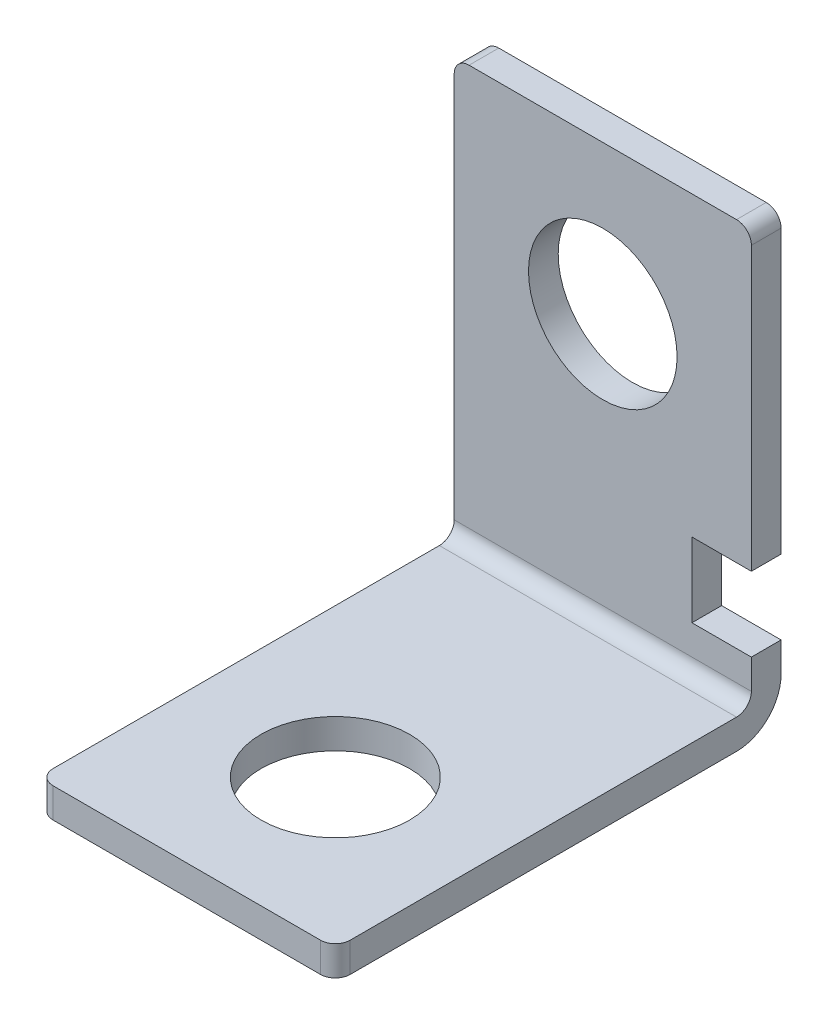
ISO-10303-21;
HEADER;
FILE_DESCRIPTION(('STEP AP214'),'2;1');
FILE_NAME('part.step','',(''),(''),'','','');
FILE_SCHEMA(('AUTOMOTIVE_DESIGN { 1 0 10303 214 1 1 1 1 }'));
ENDSEC;
DATA;
#1=APPLICATION_CONTEXT('core data for automotive mechanical design processes');
#2=APPLICATION_PROTOCOL_DEFINITION('international standard','automotive_design',2000,#1);
#3=PRODUCT_CONTEXT('',#1,'mechanical');
#4=PRODUCT('Part','Part','',(#3));
#5=PRODUCT_RELATED_PRODUCT_CATEGORY('part','',(#4));
#6=PRODUCT_DEFINITION_FORMATION('','',#4);
#7=PRODUCT_DEFINITION_CONTEXT('part definition',#1,'design');
#8=PRODUCT_DEFINITION('design','',#6,#7);
#9=PRODUCT_DEFINITION_SHAPE('','',#8);
#10=(LENGTH_UNIT() NAMED_UNIT(*) SI_UNIT(.MILLI.,.METRE.));
#11=(NAMED_UNIT(*) PLANE_ANGLE_UNIT() SI_UNIT($,.RADIAN.));
#12=(NAMED_UNIT(*) SI_UNIT($,.STERADIAN.) SOLID_ANGLE_UNIT());
#13=UNCERTAINTY_MEASURE_WITH_UNIT(LENGTH_MEASURE(1.E-05),#10,'distance_accuracy_value','');
#14=(GEOMETRIC_REPRESENTATION_CONTEXT(3) GLOBAL_UNCERTAINTY_ASSIGNED_CONTEXT((#13)) GLOBAL_UNIT_ASSIGNED_CONTEXT((#10,
#11,#12)) REPRESENTATION_CONTEXT('',''));
#15=CARTESIAN_POINT('',(0.,0.,0.));
#16=DIRECTION('',(0.,0.,1.));
#17=DIRECTION('',(1.,0.,0.));
#18=AXIS2_PLACEMENT_3D('',#15,#16,#17);
#19=CARTESIAN_POINT('',(10.,0.,0.));
#20=DIRECTION('',(-1.,0.,0.));
#21=DIRECTION('',(0.,0.,1.));
#22=AXIS2_PLACEMENT_3D('',#19,#20,#21);
#23=PLANE('',#22);
#24=DIRECTION('',(0.,0.,-1.));
#25=VECTOR('',#24,1.);
#26=CARTESIAN_POINT('',(10.,2.,30.));
#27=LINE('',#26,#25);
#28=CARTESIAN_POINT('',(10.,2.,29.));
#29=VERTEX_POINT('',#28);
#30=CARTESIAN_POINT('',(10.,2.,3.));
#31=VERTEX_POINT('',#30);
#32=EDGE_CURVE('E192',#29,#31,#27,.T.);
#33=ORIENTED_EDGE('',*,*,#32,.F.);
#34=DIRECTION('',(0.,1.,0.));
#35=VECTOR('',#34,1.);
#36=CARTESIAN_POINT('',(10.,0.,29.));
#37=LINE('',#36,#35);
#38=CARTESIAN_POINT('',(10.,0.,29.));
#39=VERTEX_POINT('',#38);
#40=EDGE_CURVE('E264',#29,#39,#37,.F.);
#41=ORIENTED_EDGE('',*,*,#40,.T.);
#42=DIRECTION('',(0.,0.,-1.));
#43=VECTOR('',#42,1.);
#44=CARTESIAN_POINT('',(10.,0.,30.));
#45=LINE('',#44,#43);
#46=CARTESIAN_POINT('',(10.,0.,3.00000000000001));
#47=VERTEX_POINT('',#46);
#48=EDGE_CURVE('E194',#39,#47,#45,.T.);
#49=ORIENTED_EDGE('',*,*,#48,.T.);
#50=CARTESIAN_POINT('',(10.,3.,3.));
#51=DIRECTION('',(-1.,0.,0.));
#52=DIRECTION('',(0.,0.,1.));
#53=AXIS2_PLACEMENT_3D('',#50,#51,#52);
#54=CIRCLE('',#53,3.);
#55=CARTESIAN_POINT('',(10.,3.,0.));
#56=VERTEX_POINT('',#55);
#57=EDGE_CURVE('E228',#47,#56,#54,.F.);
#58=ORIENTED_EDGE('',*,*,#57,.T.);
#59=DIRECTION('',(0.,1.,0.));
#60=VECTOR('',#59,1.);
#61=CARTESIAN_POINT('',(10.,0.,0.));
#62=LINE('',#61,#60);
#63=CARTESIAN_POINT('',(10.,5.,0.));
#64=VERTEX_POINT('',#63);
#65=EDGE_CURVE('E186',#56,#64,#62,.T.);
#66=ORIENTED_EDGE('',*,*,#65,.T.);
#67=DIRECTION('',(0.,0.,-1.));
#68=VECTOR('',#67,1.);
#69=CARTESIAN_POINT('',(10.,5.,0.));
#70=LINE('',#69,#68);
#71=CARTESIAN_POINT('',(10.,5.,2.));
#72=VERTEX_POINT('',#71);
#73=EDGE_CURVE('E215',#72,#64,#70,.T.);
#74=ORIENTED_EDGE('',*,*,#73,.F.);
#75=DIRECTION('',(0.,1.,0.));
#76=VECTOR('',#75,1.);
#77=CARTESIAN_POINT('',(10.,0.,2.));
#78=LINE('',#77,#76);
#79=CARTESIAN_POINT('',(10.,3.,2.));
#80=VERTEX_POINT('',#79);
#81=EDGE_CURVE('E190',#80,#72,#78,.T.);
#82=ORIENTED_EDGE('',*,*,#81,.F.);
#83=CARTESIAN_POINT('',(10.,3.,3.));
#84=DIRECTION('',(-1.,0.,0.));
#85=DIRECTION('',(0.,0.,1.));
#86=AXIS2_PLACEMENT_3D('',#83,#84,#85);
#87=CIRCLE('',#86,1.);
#88=EDGE_CURVE('E237',#80,#31,#87,.T.);
#89=ORIENTED_EDGE('',*,*,#88,.T.);
#90=EDGE_LOOP('',(#33,#41,#49,#58,#66,#74,#82,#89));
#91=FACE_BOUND('',#90,.T.);
#92=ADVANCED_FACE('F36',(#91),#23,.F.);
#93=CARTESIAN_POINT('',(10.,0.,0.));
#94=DIRECTION('',(0.,0.,1.));
#95=DIRECTION('',(1.,0.,0.));
#96=AXIS2_PLACEMENT_3D('',#93,#94,#95);
#97=PLANE('',#96);
#98=CARTESIAN_POINT('',(0.,20.,0.));
#99=DIRECTION('',(0.,0.,1.));
#100=DIRECTION('',(1.,0.,0.));
#101=AXIS2_PLACEMENT_3D('',#98,#99,#100);
#102=CIRCLE('',#101,5.);
#103=CARTESIAN_POINT('',(5.,20.,0.));
#104=VERTEX_POINT('',#103);
#105=EDGE_CURVE('E171',#104,#104,#102,.T.);
#106=ORIENTED_EDGE('',*,*,#105,.T.);
#107=EDGE_LOOP('',(#106));
#108=FACE_BOUND('',#107,.T.);
#109=DIRECTION('',(0.,1.,0.));
#110=VECTOR('',#109,1.);
#111=CARTESIAN_POINT('',(-10.,0.,0.));
#112=LINE('',#111,#110);
#113=CARTESIAN_POINT('',(-10.,3.,0.));
#114=VERTEX_POINT('',#113);
#115=CARTESIAN_POINT('',(-10.,29.,0.));
#116=VERTEX_POINT('',#115);
#117=EDGE_CURVE('E185',#114,#116,#112,.T.);
#118=ORIENTED_EDGE('',*,*,#117,.T.);
#119=CARTESIAN_POINT('',(-9.,29.,0.));
#120=DIRECTION('',(0.,0.,1.));
#121=DIRECTION('',(1.,0.,0.));
#122=AXIS2_PLACEMENT_3D('',#119,#120,#121);
#123=CIRCLE('',#122,1.);
#124=CARTESIAN_POINT('',(-9.,30.,0.));
#125=VERTEX_POINT('',#124);
#126=EDGE_CURVE('E268',#116,#125,#123,.F.);
#127=ORIENTED_EDGE('',*,*,#126,.T.);
#128=DIRECTION('',(-1.,0.,0.));
#129=VECTOR('',#128,1.);
#130=CARTESIAN_POINT('',(10.,30.,0.));
#131=LINE('',#130,#129);
#132=CARTESIAN_POINT('',(9.,30.,0.));
#133=VERTEX_POINT('',#132);
#134=EDGE_CURVE('E213',#133,#125,#131,.T.);
#135=ORIENTED_EDGE('',*,*,#134,.F.);
#136=CARTESIAN_POINT('',(9.,29.,0.));
#137=DIRECTION('',(0.,0.,1.));
#138=DIRECTION('',(1.,0.,0.));
#139=AXIS2_PLACEMENT_3D('',#136,#137,#138);
#140=CIRCLE('',#139,1.);
#141=CARTESIAN_POINT('',(10.,29.,0.));
#142=VERTEX_POINT('',#141);
#143=EDGE_CURVE('E266',#133,#142,#140,.F.);
#144=ORIENTED_EDGE('',*,*,#143,.T.);
#145=CARTESIAN_POINT('',(10.,10.,0.));
#146=VERTEX_POINT('',#145);
#147=EDGE_CURVE('E189',#146,#142,#62,.T.);
#148=ORIENTED_EDGE('',*,*,#147,.F.);
#149=DIRECTION('',(-1.,0.,0.));
#150=VECTOR('',#149,1.);
#151=CARTESIAN_POINT('',(10.,10.,0.));
#152=LINE('',#151,#150);
#153=CARTESIAN_POINT('',(6.,10.,0.));
#154=VERTEX_POINT('',#153);
#155=EDGE_CURVE('E182',#146,#154,#152,.T.);
#156=ORIENTED_EDGE('',*,*,#155,.T.);
#157=DIRECTION('',(0.,-1.,0.));
#158=VECTOR('',#157,1.);
#159=CARTESIAN_POINT('',(6.,0.,0.));
#160=LINE('',#159,#158);
#161=CARTESIAN_POINT('',(6.,5.,0.));
#162=VERTEX_POINT('',#161);
#163=EDGE_CURVE('E159',#154,#162,#160,.T.);
#164=ORIENTED_EDGE('',*,*,#163,.T.);
#165=DIRECTION('',(-1.,0.,0.));
#166=VECTOR('',#165,1.);
#167=CARTESIAN_POINT('',(10.,5.,0.));
#168=LINE('',#167,#166);
#169=EDGE_CURVE('E179',#64,#162,#168,.T.);
#170=ORIENTED_EDGE('',*,*,#169,.F.);
#171=ORIENTED_EDGE('',*,*,#65,.F.);
#172=DIRECTION('',(-1.,0.,0.));
#173=VECTOR('',#172,1.);
#174=CARTESIAN_POINT('',(10.,3.,0.));
#175=LINE('',#174,#173);
#176=EDGE_CURVE('E219',#56,#114,#175,.T.);
#177=ORIENTED_EDGE('',*,*,#176,.T.);
#178=EDGE_LOOP('',(#118,#127,#135,#144,#148,#156,#164,#170,#171,#177));
#179=FACE_BOUND('',#178,.T.);
#180=ADVANCED_FACE('F288',(#108,#179),#97,.F.);
#181=CARTESIAN_POINT('',(10.,30.,2.));
#182=DIRECTION('',(0.,1.,0.));
#183=DIRECTION('',(0.,0.,1.));
#184=AXIS2_PLACEMENT_3D('',#181,#182,#183);
#185=PLANE('',#184);
#186=ORIENTED_EDGE('',*,*,#134,.T.);
#187=DIRECTION('',(0.,0.,-1.));
#188=VECTOR('',#187,1.);
#189=CARTESIAN_POINT('',(-9.,30.,2.));
#190=LINE('',#189,#188);
#191=CARTESIAN_POINT('',(-9.,30.,2.));
#192=VERTEX_POINT('',#191);
#193=EDGE_CURVE('E57',#125,#192,#190,.F.);
#194=ORIENTED_EDGE('',*,*,#193,.T.);
#195=DIRECTION('',(-1.,0.,0.));
#196=VECTOR('',#195,1.);
#197=CARTESIAN_POINT('',(10.,30.,2.));
#198=LINE('',#197,#196);
#199=CARTESIAN_POINT('',(9.,30.,2.));
#200=VERTEX_POINT('',#199);
#201=EDGE_CURVE('E211',#200,#192,#198,.T.);
#202=ORIENTED_EDGE('',*,*,#201,.F.);
#203=DIRECTION('',(0.,0.,-1.));
#204=VECTOR('',#203,1.);
#205=CARTESIAN_POINT('',(9.,30.,0.));
#206=LINE('',#205,#204);
#207=EDGE_CURVE('E270',#200,#133,#206,.T.);
#208=ORIENTED_EDGE('',*,*,#207,.T.);
#209=EDGE_LOOP('',(#186,#194,#202,#208));
#210=FACE_BOUND('',#209,.T.);
#211=ADVANCED_FACE('F289',(#210),#185,.T.);
#212=CARTESIAN_POINT('',(10.,0.,2.));
#213=DIRECTION('',(0.,0.,1.));
#214=DIRECTION('',(1.,0.,0.));
#215=AXIS2_PLACEMENT_3D('',#212,#213,#214);
#216=PLANE('',#215);
#217=CARTESIAN_POINT('',(0.,20.,2.));
#218=DIRECTION('',(0.,0.,1.));
#219=DIRECTION('',(1.,0.,0.));
#220=AXIS2_PLACEMENT_3D('',#217,#218,#219);
#221=CIRCLE('',#220,5.);
#222=CARTESIAN_POINT('',(5.,20.,2.));
#223=VERTEX_POINT('',#222);
#224=EDGE_CURVE('E244',#223,#223,#221,.T.);
#225=ORIENTED_EDGE('',*,*,#224,.F.);
#226=EDGE_LOOP('',(#225));
#227=FACE_BOUND('',#226,.T.);
#228=ORIENTED_EDGE('',*,*,#201,.T.);
#229=CARTESIAN_POINT('',(-9.,29.,2.));
#230=DIRECTION('',(0.,0.,1.));
#231=DIRECTION('',(1.,0.,0.));
#232=AXIS2_PLACEMENT_3D('',#229,#230,#231);
#233=CIRCLE('',#232,1.);
#234=CARTESIAN_POINT('',(-10.,29.,2.));
#235=VERTEX_POINT('',#234);
#236=EDGE_CURVE('E44',#192,#235,#233,.T.);
#237=ORIENTED_EDGE('',*,*,#236,.T.);
#238=DIRECTION('',(0.,1.,0.));
#239=VECTOR('',#238,1.);
#240=CARTESIAN_POINT('',(-10.,0.,2.));
#241=LINE('',#240,#239);
#242=CARTESIAN_POINT('',(-10.,3.,2.));
#243=VERTEX_POINT('',#242);
#244=EDGE_CURVE('E199',#243,#235,#241,.T.);
#245=ORIENTED_EDGE('',*,*,#244,.F.);
#246=DIRECTION('',(-1.,0.,0.));
#247=VECTOR('',#246,1.);
#248=CARTESIAN_POINT('',(10.,3.,2.));
#249=LINE('',#248,#247);
#250=EDGE_CURVE('E233',#243,#80,#249,.F.);
#251=ORIENTED_EDGE('',*,*,#250,.T.);
#252=ORIENTED_EDGE('',*,*,#81,.T.);
#253=DIRECTION('',(-1.,0.,0.));
#254=VECTOR('',#253,1.);
#255=CARTESIAN_POINT('',(10.,5.,2.));
#256=LINE('',#255,#254);
#257=CARTESIAN_POINT('',(6.,5.,2.));
#258=VERTEX_POINT('',#257);
#259=EDGE_CURVE('E163',#72,#258,#256,.T.);
#260=ORIENTED_EDGE('',*,*,#259,.T.);
#261=DIRECTION('',(0.,-1.,0.));
#262=VECTOR('',#261,1.);
#263=CARTESIAN_POINT('',(6.,10.,2.));
#264=LINE('',#263,#262);
#265=CARTESIAN_POINT('',(6.,10.,2.));
#266=VERTEX_POINT('',#265);
#267=EDGE_CURVE('E156',#266,#258,#264,.T.);
#268=ORIENTED_EDGE('',*,*,#267,.F.);
#269=DIRECTION('',(-1.,0.,0.));
#270=VECTOR('',#269,1.);
#271=CARTESIAN_POINT('',(10.,10.,2.));
#272=LINE('',#271,#270);
#273=CARTESIAN_POINT('',(10.,10.,2.));
#274=VERTEX_POINT('',#273);
#275=EDGE_CURVE('E166',#274,#266,#272,.T.);
#276=ORIENTED_EDGE('',*,*,#275,.F.);
#277=CARTESIAN_POINT('',(10.,29.,2.));
#278=VERTEX_POINT('',#277);
#279=EDGE_CURVE('E188',#274,#278,#78,.T.);
#280=ORIENTED_EDGE('',*,*,#279,.T.);
#281=CARTESIAN_POINT('',(9.,29.,2.));
#282=DIRECTION('',(0.,0.,1.));
#283=DIRECTION('',(1.,0.,0.));
#284=AXIS2_PLACEMENT_3D('',#281,#282,#283);
#285=CIRCLE('',#284,1.);
#286=EDGE_CURVE('E274',#278,#200,#285,.T.);
#287=ORIENTED_EDGE('',*,*,#286,.T.);
#288=EDGE_LOOP('',(#228,#237,#245,#251,#252,#260,#268,#276,#280,#287));
#289=FACE_BOUND('',#288,.T.);
#290=ADVANCED_FACE('F173',(#227,#289),#216,.T.);
#291=CARTESIAN_POINT('',(10.,2.,30.));
#292=DIRECTION('',(0.,1.,0.));
#293=DIRECTION('',(0.,0.,1.));
#294=AXIS2_PLACEMENT_3D('',#291,#292,#293);
#295=PLANE('',#294);
#296=CARTESIAN_POINT('',(0.,2.,20.));
#297=DIRECTION('',(0.,1.,0.));
#298=DIRECTION('',(0.,0.,1.));
#299=AXIS2_PLACEMENT_3D('',#296,#297,#298);
#300=CIRCLE('',#299,5.);
#301=CARTESIAN_POINT('',(0.,2.,25.));
#302=VERTEX_POINT('',#301);
#303=EDGE_CURVE('E245',#302,#302,#300,.T.);
#304=ORIENTED_EDGE('',*,*,#303,.F.);
#305=EDGE_LOOP('',(#304));
#306=FACE_BOUND('',#305,.T.);
#307=DIRECTION('',(0.,0.,-1.));
#308=VECTOR('',#307,1.);
#309=CARTESIAN_POINT('',(-10.,2.,30.));
#310=LINE('',#309,#308);
#311=CARTESIAN_POINT('',(-10.,2.,29.));
#312=VERTEX_POINT('',#311);
#313=CARTESIAN_POINT('',(-10.,2.,3.));
#314=VERTEX_POINT('',#313);
#315=EDGE_CURVE('E202',#312,#314,#310,.T.);
#316=ORIENTED_EDGE('',*,*,#315,.F.);
#317=CARTESIAN_POINT('',(-9.,2.,29.));
#318=DIRECTION('',(0.,1.,0.));
#319=DIRECTION('',(0.,0.,1.));
#320=AXIS2_PLACEMENT_3D('',#317,#318,#319);
#321=CIRCLE('',#320,1.);
#322=CARTESIAN_POINT('',(-9.,2.,30.));
#323=VERTEX_POINT('',#322);
#324=EDGE_CURVE('E253',#312,#323,#321,.T.);
#325=ORIENTED_EDGE('',*,*,#324,.T.);
#326=DIRECTION('',(-1.,0.,0.));
#327=VECTOR('',#326,1.);
#328=CARTESIAN_POINT('',(10.,2.,30.));
#329=LINE('',#328,#327);
#330=CARTESIAN_POINT('',(9.,2.,30.));
#331=VERTEX_POINT('',#330);
#332=EDGE_CURVE('E208',#331,#323,#329,.T.);
#333=ORIENTED_EDGE('',*,*,#332,.F.);
#334=CARTESIAN_POINT('',(9.,2.,29.));
#335=DIRECTION('',(0.,1.,0.));
#336=DIRECTION('',(0.,0.,1.));
#337=AXIS2_PLACEMENT_3D('',#334,#335,#336);
#338=CIRCLE('',#337,1.);
#339=EDGE_CURVE('E251',#331,#29,#338,.T.);
#340=ORIENTED_EDGE('',*,*,#339,.T.);
#341=ORIENTED_EDGE('',*,*,#32,.T.);
#342=DIRECTION('',(-1.,0.,0.));
#343=VECTOR('',#342,1.);
#344=CARTESIAN_POINT('',(-10.,2.,3.));
#345=LINE('',#344,#343);
#346=EDGE_CURVE('E230',#31,#314,#345,.T.);
#347=ORIENTED_EDGE('',*,*,#346,.T.);
#348=EDGE_LOOP('',(#316,#325,#333,#340,#341,#347));
#349=FACE_BOUND('',#348,.T.);
#350=ADVANCED_FACE('F347',(#306,#349),#295,.T.);
#351=CARTESIAN_POINT('',(10.,0.,30.));
#352=DIRECTION('',(0.,0.,1.));
#353=DIRECTION('',(1.,0.,0.));
#354=AXIS2_PLACEMENT_3D('',#351,#352,#353);
#355=PLANE('',#354);
#356=ORIENTED_EDGE('',*,*,#332,.T.);
#357=DIRECTION('',(0.,1.,0.));
#358=VECTOR('',#357,1.);
#359=CARTESIAN_POINT('',(-9.,0.,30.));
#360=LINE('',#359,#358);
#361=CARTESIAN_POINT('',(-9.,0.,30.));
#362=VERTEX_POINT('',#361);
#363=EDGE_CURVE('E258',#323,#362,#360,.F.);
#364=ORIENTED_EDGE('',*,*,#363,.T.);
#365=DIRECTION('',(-1.,0.,0.));
#366=VECTOR('',#365,1.);
#367=CARTESIAN_POINT('',(10.,0.,30.));
#368=LINE('',#367,#366);
#369=CARTESIAN_POINT('',(9.,0.,30.));
#370=VERTEX_POINT('',#369);
#371=EDGE_CURVE('E196',#370,#362,#368,.T.);
#372=ORIENTED_EDGE('',*,*,#371,.F.);
#373=DIRECTION('',(0.,1.,0.));
#374=VECTOR('',#373,1.);
#375=CARTESIAN_POINT('',(9.,2.,30.));
#376=LINE('',#375,#374);
#377=EDGE_CURVE('E255',#370,#331,#376,.T.);
#378=ORIENTED_EDGE('',*,*,#377,.T.);
#379=EDGE_LOOP('',(#356,#364,#372,#378));
#380=FACE_BOUND('',#379,.T.);
#381=ADVANCED_FACE('F303',(#380),#355,.T.);
#382=CARTESIAN_POINT('',(10.,0.,30.));
#383=DIRECTION('',(0.,1.,0.));
#384=DIRECTION('',(0.,0.,1.));
#385=AXIS2_PLACEMENT_3D('',#382,#383,#384);
#386=PLANE('',#385);
#387=CARTESIAN_POINT('',(0.,0.,20.));
#388=DIRECTION('',(0.,1.,0.));
#389=DIRECTION('',(0.,0.,1.));
#390=AXIS2_PLACEMENT_3D('',#387,#388,#389);
#391=CIRCLE('',#390,5.);
#392=CARTESIAN_POINT('',(0.,0.,25.));
#393=VERTEX_POINT('',#392);
#394=EDGE_CURVE('E241',#393,#393,#391,.T.);
#395=ORIENTED_EDGE('',*,*,#394,.T.);
#396=EDGE_LOOP('',(#395));
#397=FACE_BOUND('',#396,.T.);
#398=ORIENTED_EDGE('',*,*,#371,.T.);
#399=CARTESIAN_POINT('',(-9.,0.,29.));
#400=DIRECTION('',(0.,1.,0.));
#401=DIRECTION('',(0.,0.,1.));
#402=AXIS2_PLACEMENT_3D('',#399,#400,#401);
#403=CIRCLE('',#402,1.);
#404=CARTESIAN_POINT('',(-10.,0.,29.));
#405=VERTEX_POINT('',#404);
#406=EDGE_CURVE('E262',#362,#405,#403,.F.);
#407=ORIENTED_EDGE('',*,*,#406,.T.);
#408=DIRECTION('',(0.,0.,-1.));
#409=VECTOR('',#408,1.);
#410=CARTESIAN_POINT('',(-10.,0.,30.));
#411=LINE('',#410,#409);
#412=CARTESIAN_POINT('',(-10.,0.,3.00000000000001));
#413=VERTEX_POINT('',#412);
#414=EDGE_CURVE('E204',#405,#413,#411,.T.);
#415=ORIENTED_EDGE('',*,*,#414,.T.);
#416=DIRECTION('',(-1.,0.,0.));
#417=VECTOR('',#416,1.);
#418=CARTESIAN_POINT('',(10.,0.,3.));
#419=LINE('',#418,#417);
#420=EDGE_CURVE('E225',#413,#47,#419,.F.);
#421=ORIENTED_EDGE('',*,*,#420,.T.);
#422=ORIENTED_EDGE('',*,*,#48,.F.);
#423=CARTESIAN_POINT('',(9.,0.,29.));
#424=DIRECTION('',(0.,1.,0.));
#425=DIRECTION('',(0.,0.,1.));
#426=AXIS2_PLACEMENT_3D('',#423,#424,#425);
#427=CIRCLE('',#426,1.);
#428=EDGE_CURVE('E260',#39,#370,#427,.F.);
#429=ORIENTED_EDGE('',*,*,#428,.T.);
#430=EDGE_LOOP('',(#398,#407,#415,#421,#422,#429));
#431=FACE_BOUND('',#430,.T.);
#432=ADVANCED_FACE('F296',(#397,#431),#386,.F.);
#433=ORIENTED_EDGE('',*,*,#147,.T.);
#434=DIRECTION('',(0.,0.,-1.));
#435=VECTOR('',#434,1.);
#436=CARTESIAN_POINT('',(10.,29.,2.));
#437=LINE('',#436,#435);
#438=EDGE_CURVE('E11',#142,#278,#437,.F.);
#439=ORIENTED_EDGE('',*,*,#438,.T.);
#440=ORIENTED_EDGE('',*,*,#279,.F.);
#441=DIRECTION('',(0.,0.,-1.));
#442=VECTOR('',#441,1.);
#443=CARTESIAN_POINT('',(10.,10.,0.));
#444=LINE('',#443,#442);
#445=EDGE_CURVE('E169',#274,#146,#444,.T.);
#446=ORIENTED_EDGE('',*,*,#445,.T.);
#447=EDGE_LOOP('',(#433,#439,#440,#446));
#448=FACE_BOUND('',#447,.T.);
#449=ADVANCED_FACE('F294',(#448),#23,.F.);
#450=CARTESIAN_POINT('',(-10.,0.,0.));
#451=DIRECTION('',(-1.,0.,0.));
#452=DIRECTION('',(0.,0.,1.));
#453=AXIS2_PLACEMENT_3D('',#450,#451,#452);
#454=PLANE('',#453);
#455=ORIENTED_EDGE('',*,*,#414,.F.);
#456=DIRECTION('',(0.,1.,0.));
#457=VECTOR('',#456,1.);
#458=CARTESIAN_POINT('',(-10.,0.,29.));
#459=LINE('',#458,#457);
#460=EDGE_CURVE('E248',#405,#312,#459,.T.);
#461=ORIENTED_EDGE('',*,*,#460,.T.);
#462=ORIENTED_EDGE('',*,*,#315,.T.);
#463=CARTESIAN_POINT('',(-10.,3.,3.));
#464=DIRECTION('',(-1.,0.,0.));
#465=DIRECTION('',(0.,0.,1.));
#466=AXIS2_PLACEMENT_3D('',#463,#464,#465);
#467=CIRCLE('',#466,1.);
#468=EDGE_CURVE('E235',#314,#243,#467,.F.);
#469=ORIENTED_EDGE('',*,*,#468,.T.);
#470=ORIENTED_EDGE('',*,*,#244,.T.);
#471=DIRECTION('',(0.,0.,-1.));
#472=VECTOR('',#471,1.);
#473=CARTESIAN_POINT('',(-10.,29.,0.));
#474=LINE('',#473,#472);
#475=EDGE_CURVE('E240',#235,#116,#474,.T.);
#476=ORIENTED_EDGE('',*,*,#475,.T.);
#477=ORIENTED_EDGE('',*,*,#117,.F.);
#478=CARTESIAN_POINT('',(-10.,3.,3.));
#479=DIRECTION('',(-1.,0.,0.));
#480=DIRECTION('',(0.,0.,1.));
#481=AXIS2_PLACEMENT_3D('',#478,#479,#480);
#482=CIRCLE('',#481,3.);
#483=EDGE_CURVE('E222',#114,#413,#482,.T.);
#484=ORIENTED_EDGE('',*,*,#483,.T.);
#485=EDGE_LOOP('',(#455,#461,#462,#469,#470,#476,#477,#484));
#486=FACE_BOUND('',#485,.T.);
#487=ADVANCED_FACE('F282',(#486),#454,.T.);
#488=CARTESIAN_POINT('',(6.,10.,-8.));
#489=DIRECTION('',(-1.,0.,0.));
#490=DIRECTION('',(0.,-1.,0.));
#491=AXIS2_PLACEMENT_3D('',#488,#489,#490);
#492=PLANE('',#491);
#493=DIRECTION('',(0.,0.,1.));
#494=VECTOR('',#493,1.);
#495=CARTESIAN_POINT('',(6.,10.,-8.));
#496=LINE('',#495,#494);
#497=EDGE_CURVE('E151',#154,#266,#496,.T.);
#498=ORIENTED_EDGE('',*,*,#497,.T.);
#499=ORIENTED_EDGE('',*,*,#267,.T.);
#500=DIRECTION('',(0.,0.,1.));
#501=VECTOR('',#500,1.);
#502=CARTESIAN_POINT('',(6.,5.,-8.));
#503=LINE('',#502,#501);
#504=EDGE_CURVE('E162',#162,#258,#503,.T.);
#505=ORIENTED_EDGE('',*,*,#504,.F.);
#506=ORIENTED_EDGE('',*,*,#163,.F.);
#507=EDGE_LOOP('',(#498,#499,#505,#506));
#508=FACE_BOUND('',#507,.T.);
#509=ADVANCED_FACE('F153',(#508),#492,.F.);
#510=CARTESIAN_POINT('',(10.,10.,-8.));
#511=DIRECTION('',(0.,1.,0.));
#512=DIRECTION('',(-1.,0.,0.));
#513=AXIS2_PLACEMENT_3D('',#510,#511,#512);
#514=PLANE('',#513);
#515=ORIENTED_EDGE('',*,*,#445,.F.);
#516=ORIENTED_EDGE('',*,*,#275,.T.);
#517=ORIENTED_EDGE('',*,*,#497,.F.);
#518=ORIENTED_EDGE('',*,*,#155,.F.);
#519=EDGE_LOOP('',(#515,#516,#517,#518));
#520=FACE_BOUND('',#519,.T.);
#521=ADVANCED_FACE('F167',(#520),#514,.F.);
#522=CARTESIAN_POINT('',(10.,5.,-8.));
#523=DIRECTION('',(0.,1.,0.));
#524=DIRECTION('',(0.,0.,1.));
#525=AXIS2_PLACEMENT_3D('',#522,#523,#524);
#526=PLANE('',#525);
#527=ORIENTED_EDGE('',*,*,#169,.T.);
#528=ORIENTED_EDGE('',*,*,#504,.T.);
#529=ORIENTED_EDGE('',*,*,#259,.F.);
#530=ORIENTED_EDGE('',*,*,#73,.T.);
#531=EDGE_LOOP('',(#527,#528,#529,#530));
#532=FACE_BOUND('',#531,.T.);
#533=ADVANCED_FACE('F344',(#532),#526,.T.);
#534=CARTESIAN_POINT('',(10.,3.,3.));
#535=DIRECTION('',(-1.,0.,0.));
#536=DIRECTION('',(0.,0.,1.));
#537=AXIS2_PLACEMENT_3D('',#534,#535,#536);
#538=CYLINDRICAL_SURFACE('',#537,3.);
#539=ORIENTED_EDGE('',*,*,#57,.F.);
#540=ORIENTED_EDGE('',*,*,#420,.F.);
#541=ORIENTED_EDGE('',*,*,#483,.F.);
#542=ORIENTED_EDGE('',*,*,#176,.F.);
#543=EDGE_LOOP('',(#539,#540,#541,#542));
#544=FACE_BOUND('',#543,.T.);
#545=ADVANCED_FACE('F339',(#544),#538,.T.);
#546=CARTESIAN_POINT('',(10.,3.,3.));
#547=DIRECTION('',(1.,0.,0.));
#548=DIRECTION('',(0.,0.,-1.));
#549=AXIS2_PLACEMENT_3D('',#546,#547,#548);
#550=CYLINDRICAL_SURFACE('',#549,1.);
#551=ORIENTED_EDGE('',*,*,#88,.F.);
#552=ORIENTED_EDGE('',*,*,#250,.F.);
#553=ORIENTED_EDGE('',*,*,#468,.F.);
#554=ORIENTED_EDGE('',*,*,#346,.F.);
#555=EDGE_LOOP('',(#551,#552,#553,#554));
#556=FACE_BOUND('',#555,.T.);
#557=ADVANCED_FACE('F346',(#556),#550,.F.);
#558=CARTESIAN_POINT('',(0.,20.,-8.));
#559=DIRECTION('',(0.,0.,1.));
#560=DIRECTION('',(1.,0.,0.));
#561=AXIS2_PLACEMENT_3D('',#558,#559,#560);
#562=CYLINDRICAL_SURFACE('',#561,5.);
#563=ORIENTED_EDGE('',*,*,#224,.T.);
#564=EDGE_LOOP('',(#563));
#565=FACE_BOUND('',#564,.T.);
#566=ORIENTED_EDGE('',*,*,#105,.F.);
#567=EDGE_LOOP('',(#566));
#568=FACE_BOUND('',#567,.T.);
#569=ADVANCED_FACE('F366',(#565,#568),#562,.F.);
#570=CARTESIAN_POINT('',(0.,-8.,20.));
#571=DIRECTION('',(0.,1.,0.));
#572=DIRECTION('',(0.,0.,1.));
#573=AXIS2_PLACEMENT_3D('',#570,#571,#572);
#574=CYLINDRICAL_SURFACE('',#573,5.);
#575=ORIENTED_EDGE('',*,*,#303,.T.);
#576=EDGE_LOOP('',(#575));
#577=FACE_BOUND('',#576,.T.);
#578=ORIENTED_EDGE('',*,*,#394,.F.);
#579=EDGE_LOOP('',(#578));
#580=FACE_BOUND('',#579,.T.);
#581=ADVANCED_FACE('F369',(#577,#580),#574,.F.);
#582=CARTESIAN_POINT('',(-9.,0.,29.));
#583=DIRECTION('',(0.,1.,0.));
#584=DIRECTION('',(0.,0.,1.));
#585=AXIS2_PLACEMENT_3D('',#582,#583,#584);
#586=CYLINDRICAL_SURFACE('',#585,1.);
#587=ORIENTED_EDGE('',*,*,#406,.F.);
#588=ORIENTED_EDGE('',*,*,#363,.F.);
#589=ORIENTED_EDGE('',*,*,#324,.F.);
#590=ORIENTED_EDGE('',*,*,#460,.F.);
#591=EDGE_LOOP('',(#587,#588,#589,#590));
#592=FACE_BOUND('',#591,.T.);
#593=ADVANCED_FACE('F332',(#592),#586,.T.);
#594=CARTESIAN_POINT('',(9.,0.,29.));
#595=DIRECTION('',(0.,-1.,0.));
#596=DIRECTION('',(0.,0.,-1.));
#597=AXIS2_PLACEMENT_3D('',#594,#595,#596);
#598=CYLINDRICAL_SURFACE('',#597,1.);
#599=ORIENTED_EDGE('',*,*,#428,.F.);
#600=ORIENTED_EDGE('',*,*,#40,.F.);
#601=ORIENTED_EDGE('',*,*,#339,.F.);
#602=ORIENTED_EDGE('',*,*,#377,.F.);
#603=EDGE_LOOP('',(#599,#600,#601,#602));
#604=FACE_BOUND('',#603,.T.);
#605=ADVANCED_FACE('F323',(#604),#598,.T.);
#606=CARTESIAN_POINT('',(-9.,29.,0.));
#607=DIRECTION('',(0.,0.,-1.));
#608=DIRECTION('',(-1.,0.,0.));
#609=AXIS2_PLACEMENT_3D('',#606,#607,#608);
#610=CYLINDRICAL_SURFACE('',#609,1.);
#611=ORIENTED_EDGE('',*,*,#236,.F.);
#612=ORIENTED_EDGE('',*,*,#193,.F.);
#613=ORIENTED_EDGE('',*,*,#126,.F.);
#614=ORIENTED_EDGE('',*,*,#475,.F.);
#615=EDGE_LOOP('',(#611,#612,#613,#614));
#616=FACE_BOUND('',#615,.T.);
#617=ADVANCED_FACE('F285',(#616),#610,.T.);
#618=CARTESIAN_POINT('',(9.,29.,2.));
#619=DIRECTION('',(0.,0.,1.));
#620=DIRECTION('',(1.,0.,0.));
#621=AXIS2_PLACEMENT_3D('',#618,#619,#620);
#622=CYLINDRICAL_SURFACE('',#621,1.);
#623=ORIENTED_EDGE('',*,*,#286,.F.);
#624=ORIENTED_EDGE('',*,*,#438,.F.);
#625=ORIENTED_EDGE('',*,*,#143,.F.);
#626=ORIENTED_EDGE('',*,*,#207,.F.);
#627=EDGE_LOOP('',(#623,#624,#625,#626));
#628=FACE_BOUND('',#627,.T.);
#629=ADVANCED_FACE('F38',(#628),#622,.T.);
#630=CLOSED_SHELL('',(#92,#180,#211,#290,#350,#381,#432,#449,#487,#509,#521,#533,#545,#557,#569,
#581,#593,#605,#617,#629));
#631=MANIFOLD_SOLID_BREP('B2',#630);
#632=ADVANCED_BREP_SHAPE_REPRESENTATION('',(#18,#631),#14);
#633=SHAPE_DEFINITION_REPRESENTATION(#9,#632);
ENDSEC;
END-ISO-10303-21;
